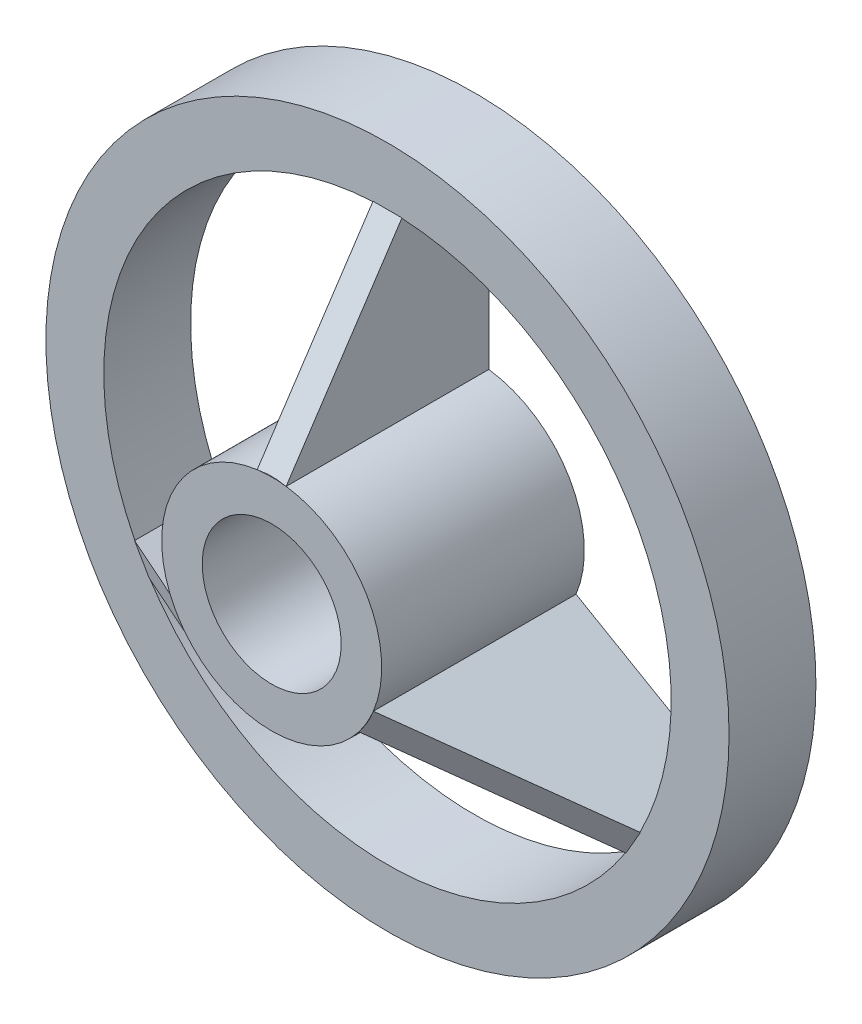
ISO-10303-21;
HEADER;
FILE_DESCRIPTION(('STEP AP214'),'2;1');
FILE_NAME('part.step','',(''),(''),'','','');
FILE_SCHEMA(('AUTOMOTIVE_DESIGN { 1 0 10303 214 1 1 1 1 }'));
ENDSEC;
DATA;
#1=APPLICATION_CONTEXT('core data for automotive mechanical design processes');
#2=APPLICATION_PROTOCOL_DEFINITION('international standard','automotive_design',2000,#1);
#3=PRODUCT_CONTEXT('',#1,'mechanical');
#4=PRODUCT('Part','Part','',(#3));
#5=PRODUCT_RELATED_PRODUCT_CATEGORY('part','',(#4));
#6=PRODUCT_DEFINITION_FORMATION('','',#4);
#7=PRODUCT_DEFINITION_CONTEXT('part definition',#1,'design');
#8=PRODUCT_DEFINITION('design','',#6,#7);
#9=PRODUCT_DEFINITION_SHAPE('','',#8);
#10=(LENGTH_UNIT() NAMED_UNIT(*) SI_UNIT(.MILLI.,.METRE.));
#11=(NAMED_UNIT(*) PLANE_ANGLE_UNIT() SI_UNIT($,.RADIAN.));
#12=(NAMED_UNIT(*) SI_UNIT($,.STERADIAN.) SOLID_ANGLE_UNIT());
#13=UNCERTAINTY_MEASURE_WITH_UNIT(LENGTH_MEASURE(1.E-05),#10,'distance_accuracy_value','');
#14=(GEOMETRIC_REPRESENTATION_CONTEXT(3) GLOBAL_UNCERTAINTY_ASSIGNED_CONTEXT((#13)) GLOBAL_UNIT_ASSIGNED_CONTEXT((#10,
#11,#12)) REPRESENTATION_CONTEXT('',''));
#15=CARTESIAN_POINT('',(0.,0.,0.));
#16=DIRECTION('',(0.,0.,1.));
#17=DIRECTION('',(1.,0.,0.));
#18=AXIS2_PLACEMENT_3D('',#15,#16,#17);
#19=CARTESIAN_POINT('',(0.,0.,1.5));
#20=DIRECTION('',(0.,0.,1.));
#21=DIRECTION('',(1.,0.,0.));
#22=AXIS2_PLACEMENT_3D('',#19,#20,#21);
#23=PLANE('',#22);
#24=DIRECTION('',(-0.866025403784443,-0.499999999999992,0.));
#25=VECTOR('',#24,1.);
#26=CARTESIAN_POINT('',(-0.124999999999998,0.216506350946111,1.5));
#27=LINE('',#26,#25);
#28=CARTESIAN_POINT('',(-4.36299775837602,-2.23030279567726,1.5));
#29=VERTEX_POINT('',#28);
#30=CARTESIAN_POINT('',(-4.36852447854377,-2.23349364905385,1.5));
#31=VERTEX_POINT('',#30);
#32=EDGE_CURVE('E178',#29,#31,#27,.T.);
#33=ORIENTED_EDGE('',*,*,#32,.F.);
#34=CARTESIAN_POINT('',(0.,0.,1.5));
#35=DIRECTION('',(0.,0.,1.));
#36=DIRECTION('',(1.,0.,0.));
#37=AXIS2_PLACEMENT_3D('',#34,#35,#36);
#38=CIRCLE('',#37,4.9);
#39=CARTESIAN_POINT('',(-0.25,4.89361829324683,1.5));
#40=VERTEX_POINT('',#39);
#41=EDGE_CURVE('E257',#40,#29,#38,.T.);
#42=ORIENTED_EDGE('',*,*,#41,.F.);
#43=DIRECTION('',(0.,-1.,0.));
#44=VECTOR('',#43,1.);
#45=CARTESIAN_POINT('',(-0.25,0.,1.5));
#46=LINE('',#45,#44);
#47=CARTESIAN_POINT('',(-0.25,4.9,1.5));
#48=VERTEX_POINT('',#47);
#49=EDGE_CURVE('E276',#48,#40,#46,.T.);
#50=ORIENTED_EDGE('',*,*,#49,.F.);
#51=DIRECTION('',(-1.,0.,0.));
#52=VECTOR('',#51,1.);
#53=CARTESIAN_POINT('',(0.25,4.9,1.5));
#54=LINE('',#53,#52);
#55=CARTESIAN_POINT('',(0.25,4.9,1.5));
#56=VERTEX_POINT('',#55);
#57=EDGE_CURVE('E302',#56,#48,#54,.T.);
#58=ORIENTED_EDGE('',*,*,#57,.F.);
#59=DIRECTION('',(0.,-1.,0.));
#60=VECTOR('',#59,1.);
#61=CARTESIAN_POINT('',(0.25,0.,1.5));
#62=LINE('',#61,#60);
#63=CARTESIAN_POINT('',(0.25,4.89361829324683,1.5));
#64=VERTEX_POINT('',#63);
#65=EDGE_CURVE('E278',#56,#64,#62,.T.);
#66=ORIENTED_EDGE('',*,*,#65,.T.);
#67=CARTESIAN_POINT('',(4.36299775837599,-2.23030279567733,1.5));
#68=VERTEX_POINT('',#67);
#69=EDGE_CURVE('E261',#68,#64,#38,.T.);
#70=ORIENTED_EDGE('',*,*,#69,.F.);
#71=DIRECTION('',(0.866025403784436,-0.500000000000004,0.));
#72=VECTOR('',#71,1.);
#73=CARTESIAN_POINT('',(0.125000000000001,0.216506350946109,1.5));
#74=LINE('',#73,#72);
#75=CARTESIAN_POINT('',(4.36852447854374,-2.23349364905391,1.5));
#76=VERTEX_POINT('',#75);
#77=EDGE_CURVE('E242',#68,#76,#74,.T.);
#78=ORIENTED_EDGE('',*,*,#77,.T.);
#79=DIRECTION('',(0.500000000000004,0.866025403784436,0.));
#80=VECTOR('',#79,1.);
#81=CARTESIAN_POINT('',(4.11852447854374,-2.66650635094613,1.5));
#82=LINE('',#81,#80);
#83=CARTESIAN_POINT('',(4.11852447854374,-2.66650635094613,1.5));
#84=VERTEX_POINT('',#83);
#85=EDGE_CURVE('E240',#84,#76,#82,.T.);
#86=ORIENTED_EDGE('',*,*,#85,.F.);
#87=DIRECTION('',(0.866025403784436,-0.500000000000004,0.));
#88=VECTOR('',#87,1.);
#89=CARTESIAN_POINT('',(-0.125000000000001,-0.216506350946109,1.5));
#90=LINE('',#89,#88);
#91=CARTESIAN_POINT('',(4.11299775837599,-2.66331549756954,1.5));
#92=VERTEX_POINT('',#91);
#93=EDGE_CURVE('E248',#92,#84,#90,.T.);
#94=ORIENTED_EDGE('',*,*,#93,.F.);
#95=CARTESIAN_POINT('',(-4.11299775837603,-2.66331549756949,1.5));
#96=VERTEX_POINT('',#95);
#97=EDGE_CURVE('E260',#96,#92,#38,.T.);
#98=ORIENTED_EDGE('',*,*,#97,.F.);
#99=DIRECTION('',(-0.866025403784443,-0.499999999999992,0.));
#100=VECTOR('',#99,1.);
#101=CARTESIAN_POINT('',(0.124999999999998,-0.216506350946111,1.5));
#102=LINE('',#101,#100);
#103=CARTESIAN_POINT('',(-4.11852447854378,-2.66650635094607,1.5));
#104=VERTEX_POINT('',#103);
#105=EDGE_CURVE('E208',#96,#104,#102,.T.);
#106=ORIENTED_EDGE('',*,*,#105,.T.);
#107=DIRECTION('',(0.499999999999992,-0.866025403784443,0.));
#108=VECTOR('',#107,1.);
#109=CARTESIAN_POINT('',(-4.36852447854377,-2.23349364905385,1.5));
#110=LINE('',#109,#108);
#111=EDGE_CURVE('E197',#31,#104,#110,.T.);
#112=ORIENTED_EDGE('',*,*,#111,.F.);
#113=EDGE_LOOP('',(#33,#42,#50,#58,#66,#70,#78,#86,#94,#98,#106,#112));
#114=FACE_BOUND('',#113,.T.);
#115=CARTESIAN_POINT('',(0.,0.,1.5));
#116=DIRECTION('',(0.,0.,1.));
#117=DIRECTION('',(1.,0.,0.));
#118=AXIS2_PLACEMENT_3D('',#115,#116,#117);
#119=CIRCLE('',#118,5.9);
#120=CARTESIAN_POINT('',(5.9,0.,1.5));
#121=VERTEX_POINT('',#120);
#122=EDGE_CURVE('E266',#121,#121,#119,.T.);
#123=ORIENTED_EDGE('',*,*,#122,.T.);
#124=EDGE_LOOP('',(#123));
#125=FACE_BOUND('',#124,.T.);
#126=ADVANCED_FACE('F40',(#114,#125),#23,.T.);
#127=CARTESIAN_POINT('',(0.,0.,3.5));
#128=DIRECTION('',(0.,0.,-1.));
#129=DIRECTION('',(-1.,0.,0.));
#130=AXIS2_PLACEMENT_3D('',#127,#128,#129);
#131=CYLINDRICAL_SURFACE('',#130,1.9);
#132=CARTESIAN_POINT('',(0.,0.,4.75060094816364));
#133=DIRECTION('',(0.478745121602799,0.27640362483059,-0.833309153149077));
#134=DIRECTION('',(-0.721666895833202,-0.416654576574532,-0.552807249661189));
#135=AXIS2_PLACEMENT_3D('',#132,#133,#134);
#136=ELLIPSE('',#135,2.28006615890381,1.9);
#137=CARTESIAN_POINT('',(-1.51415575672838,-1.14775099406025,3.5));
#138=VERTEX_POINT('',#137);
#139=CARTESIAN_POINT('',(-1.75105939643923,-0.73742185358307,3.5));
#140=VERTEX_POINT('',#139);
#141=EDGE_CURVE('E54',#138,#140,#136,.T.);
#142=ORIENTED_EDGE('',*,*,#141,.F.);
#143=CARTESIAN_POINT('',(0.,0.,3.5));
#144=DIRECTION('',(0.,0.,1.));
#145=DIRECTION('',(1.,0.,0.));
#146=AXIS2_PLACEMENT_3D('',#143,#144,#145);
#147=CIRCLE('',#146,1.9);
#148=EDGE_CURVE('E57',#140,#138,#147,.T.);
#149=ORIENTED_EDGE('',*,*,#148,.F.);
#150=EDGE_LOOP('',(#142,#149));
#151=FACE_BOUND('',#150,.T.);
#152=ADVANCED_FACE('F417',(#151),#131,.T.);
#153=DIRECTION('',(0.,0.,-1.));
#154=VECTOR('',#153,1.);
#155=CARTESIAN_POINT('',(-1.50614223781988,-1.15824676103796,3.5));
#156=LINE('',#155,#154);
#157=CARTESIAN_POINT('',(-1.50614223781988,-1.15824676103796,0.));
#158=VERTEX_POINT('',#157);
#159=CARTESIAN_POINT('',(-1.50614223781988,-1.15824676103796,3.5));
#160=VERTEX_POINT('',#159);
#161=EDGE_CURVE('E191',#158,#160,#156,.F.);
#162=ORIENTED_EDGE('',*,*,#161,.F.);
#163=CARTESIAN_POINT('',(0.,0.,0.));
#164=DIRECTION('',(0.,0.,1.));
#165=DIRECTION('',(1.,0.,0.));
#166=AXIS2_PLACEMENT_3D('',#163,#164,#165);
#167=CIRCLE('',#166,1.9);
#168=CARTESIAN_POINT('',(1.50614223781986,-1.15824676103798,0.));
#169=VERTEX_POINT('',#168);
#170=EDGE_CURVE('E319',#158,#169,#167,.T.);
#171=ORIENTED_EDGE('',*,*,#170,.T.);
#172=DIRECTION('',(0.,0.,-1.));
#173=VECTOR('',#172,1.);
#174=CARTESIAN_POINT('',(1.50614223781986,-1.15824676103799,3.5));
#175=LINE('',#174,#173);
#176=CARTESIAN_POINT('',(1.50614223781986,-1.15824676103798,3.5));
#177=VERTEX_POINT('',#176);
#178=EDGE_CURVE('E250',#169,#177,#175,.F.);
#179=ORIENTED_EDGE('',*,*,#178,.T.);
#180=EDGE_CURVE('E315',#160,#177,#147,.T.);
#181=ORIENTED_EDGE('',*,*,#180,.F.);
#182=EDGE_LOOP('',(#162,#171,#179,#181));
#183=FACE_BOUND('',#182,.T.);
#184=ADVANCED_FACE('F387',(#183),#131,.T.);
#185=CARTESIAN_POINT('',(0.,0.,1.5));
#186=DIRECTION('',(0.,0.,-1.));
#187=DIRECTION('',(-1.,0.,0.));
#188=AXIS2_PLACEMENT_3D('',#185,#186,#187);
#189=CYLINDRICAL_SURFACE('',#188,4.9);
#190=CARTESIAN_POINT('',(0.,0.,0.));
#191=DIRECTION('',(0.,0.,1.));
#192=DIRECTION('',(1.,0.,0.));
#193=AXIS2_PLACEMENT_3D('',#190,#191,#192);
#194=CIRCLE('',#193,4.9);
#195=CARTESIAN_POINT('',(-4.11299775837603,-2.66331549756949,0.));
#196=VERTEX_POINT('',#195);
#197=CARTESIAN_POINT('',(4.11299775837599,-2.66331549756954,0.));
#198=VERTEX_POINT('',#197);
#199=EDGE_CURVE('E265',#196,#198,#194,.T.);
#200=ORIENTED_EDGE('',*,*,#199,.F.);
#201=DIRECTION('',(0.,0.,-1.));
#202=VECTOR('',#201,1.);
#203=CARTESIAN_POINT('',(-4.11299775837603,-2.66331549756949,1.5));
#204=LINE('',#203,#202);
#205=EDGE_CURVE('E48',#196,#96,#204,.F.);
#206=ORIENTED_EDGE('',*,*,#205,.T.);
#207=ORIENTED_EDGE('',*,*,#97,.T.);
#208=DIRECTION('',(0.,0.,-1.));
#209=VECTOR('',#208,1.);
#210=CARTESIAN_POINT('',(4.11299775837599,-2.66331549756954,1.5));
#211=LINE('',#210,#209);
#212=EDGE_CURVE('E332',#198,#92,#211,.F.);
#213=ORIENTED_EDGE('',*,*,#212,.F.);
#214=EDGE_LOOP('',(#200,#206,#207,#213));
#215=FACE_BOUND('',#214,.T.);
#216=ADVANCED_FACE('F337',(#215),#189,.F.);
#217=CARTESIAN_POINT('',(0.,0.,4.75060094816364));
#218=DIRECTION('',(-0.478745121602795,0.276403624830597,-0.833309153149077));
#219=DIRECTION('',(0.721666895833196,-0.416654576574542,-0.552807249661189));
#220=AXIS2_PLACEMENT_3D('',#217,#218,#219);
#221=ELLIPSE('',#220,2.28006615890381,1.9);
#222=CARTESIAN_POINT('',(1.75105939643922,-0.737421853583097,3.5));
#223=VERTEX_POINT('',#222);
#224=CARTESIAN_POINT('',(1.51415575672837,-1.14775099406027,3.5));
#225=VERTEX_POINT('',#224);
#226=EDGE_CURVE('E253',#223,#225,#221,.T.);
#227=ORIENTED_EDGE('',*,*,#226,.F.);
#228=EDGE_CURVE('E395',#225,#223,#147,.T.);
#229=ORIENTED_EDGE('',*,*,#228,.F.);
#230=EDGE_LOOP('',(#227,#229));
#231=FACE_BOUND('',#230,.T.);
#232=ADVANCED_FACE('F548',(#231),#131,.T.);
#233=DIRECTION('',(0.,0.,-1.));
#234=VECTOR('',#233,1.);
#235=CARTESIAN_POINT('',(1.75614223781986,-0.725234059145767,3.5));
#236=LINE('',#235,#234);
#237=CARTESIAN_POINT('',(1.75614223781986,-0.725234059145767,0.));
#238=VERTEX_POINT('',#237);
#239=CARTESIAN_POINT('',(1.75614223781986,-0.725234059145767,3.5));
#240=VERTEX_POINT('',#239);
#241=EDGE_CURVE('E245',#238,#240,#236,.F.);
#242=ORIENTED_EDGE('',*,*,#241,.F.);
#243=CARTESIAN_POINT('',(0.25,1.88348082018374,0.));
#244=VERTEX_POINT('',#243);
#245=EDGE_CURVE('E308',#238,#244,#167,.T.);
#246=ORIENTED_EDGE('',*,*,#245,.T.);
#247=DIRECTION('',(0.,0.,-1.));
#248=VECTOR('',#247,1.);
#249=CARTESIAN_POINT('',(0.25,1.88348082018374,3.5));
#250=LINE('',#249,#248);
#251=CARTESIAN_POINT('',(0.25,1.88348082018374,3.5));
#252=VERTEX_POINT('',#251);
#253=EDGE_CURVE('E323',#244,#252,#250,.F.);
#254=ORIENTED_EDGE('',*,*,#253,.T.);
#255=EDGE_CURVE('E318',#240,#252,#147,.T.);
#256=ORIENTED_EDGE('',*,*,#255,.F.);
#257=EDGE_LOOP('',(#242,#246,#254,#256));
#258=FACE_BOUND('',#257,.T.);
#259=ADVANCED_FACE('F388',(#258),#131,.T.);
#260=CARTESIAN_POINT('',(4.36299775837599,-2.23030279567733,0.));
#261=VERTEX_POINT('',#260);
#262=CARTESIAN_POINT('',(0.25,4.89361829324683,0.));
#263=VERTEX_POINT('',#262);
#264=EDGE_CURVE('E256',#261,#263,#194,.T.);
#265=ORIENTED_EDGE('',*,*,#264,.F.);
#266=DIRECTION('',(0.,0.,-1.));
#267=VECTOR('',#266,1.);
#268=CARTESIAN_POINT('',(4.36299775837599,-2.23030279567733,1.5));
#269=LINE('',#268,#267);
#270=EDGE_CURVE('E329',#261,#68,#269,.F.);
#271=ORIENTED_EDGE('',*,*,#270,.T.);
#272=ORIENTED_EDGE('',*,*,#69,.T.);
#273=DIRECTION('',(0.,0.,-1.));
#274=VECTOR('',#273,1.);
#275=CARTESIAN_POINT('',(0.25,4.89361829324683,1.5));
#276=LINE('',#275,#274);
#277=EDGE_CURVE('E273',#64,#263,#276,.T.);
#278=ORIENTED_EDGE('',*,*,#277,.T.);
#279=EDGE_LOOP('',(#265,#271,#272,#278));
#280=FACE_BOUND('',#279,.T.);
#281=ADVANCED_FACE('F348',(#280),#189,.F.);
#282=CARTESIAN_POINT('',(0.,0.,4.75060094816364));
#283=DIRECTION('',(0.,-0.552807249661189,-0.833309153149077));
#284=DIRECTION('',(0.,0.833309153149077,-0.552807249661189));
#285=AXIS2_PLACEMENT_3D('',#282,#283,#284);
#286=ELLIPSE('',#285,2.28006615890381,1.9);
#287=CARTESIAN_POINT('',(-0.236903639710849,1.88517284764335,3.5));
#288=VERTEX_POINT('',#287);
#289=CARTESIAN_POINT('',(0.236903639710849,1.88517284764335,3.5));
#290=VERTEX_POINT('',#289);
#291=EDGE_CURVE('E326',#288,#290,#286,.T.);
#292=ORIENTED_EDGE('',*,*,#291,.F.);
#293=EDGE_CURVE('E314',#290,#288,#147,.T.);
#294=ORIENTED_EDGE('',*,*,#293,.F.);
#295=EDGE_LOOP('',(#292,#294));
#296=FACE_BOUND('',#295,.T.);
#297=ADVANCED_FACE('F418',(#296),#131,.T.);
#298=CARTESIAN_POINT('',(0.,0.,3.5));
#299=DIRECTION('',(0.,0.,1.));
#300=DIRECTION('',(1.,0.,0.));
#301=AXIS2_PLACEMENT_3D('',#298,#299,#300);
#302=PLANE('',#301);
#303=CARTESIAN_POINT('',(-0.25,1.88348082018374,3.5));
#304=VERTEX_POINT('',#303);
#305=CARTESIAN_POINT('',(-1.75614223781987,-0.725234059145742,3.5));
#306=VERTEX_POINT('',#305);
#307=EDGE_CURVE('E311',#304,#306,#147,.T.);
#308=ORIENTED_EDGE('',*,*,#307,.T.);
#309=DIRECTION('',(0.866025403784443,0.499999999999992,0.));
#310=VECTOR('',#309,1.);
#311=CARTESIAN_POINT('',(-1.7576075765838,-0.726080072875551,3.5));
#312=LINE('',#311,#310);
#313=CARTESIAN_POINT('',(-1.7576075765838,-0.726080072875551,3.5));
#314=VERTEX_POINT('',#313);
#315=EDGE_CURVE('E202',#314,#306,#312,.T.);
#316=ORIENTED_EDGE('',*,*,#315,.F.);
#317=DIRECTION('',(0.499999999999992,-0.866025403784443,0.));
#318=VECTOR('',#317,1.);
#319=CARTESIAN_POINT('',(-1.7576075765838,-0.726080072875551,3.5));
#320=LINE('',#319,#318);
#321=EDGE_CURVE('E200',#314,#140,#320,.T.);
#322=ORIENTED_EDGE('',*,*,#321,.T.);
#323=ORIENTED_EDGE('',*,*,#148,.T.);
#324=CARTESIAN_POINT('',(-1.50760757658381,-1.15909277476777,3.5));
#325=VERTEX_POINT('',#324);
#326=EDGE_CURVE('E211',#138,#325,#320,.T.);
#327=ORIENTED_EDGE('',*,*,#326,.T.);
#328=DIRECTION('',(0.866025403784443,0.499999999999992,0.));
#329=VECTOR('',#328,1.);
#330=CARTESIAN_POINT('',(-1.50760757658381,-1.15909277476777,3.5));
#331=LINE('',#330,#329);
#332=EDGE_CURVE('E402',#325,#160,#331,.T.);
#333=ORIENTED_EDGE('',*,*,#332,.T.);
#334=ORIENTED_EDGE('',*,*,#180,.T.);
#335=DIRECTION('',(-0.866025403784436,0.500000000000004,0.));
#336=VECTOR('',#335,1.);
#337=CARTESIAN_POINT('',(1.50760757658379,-1.15909277476779,3.5));
#338=LINE('',#337,#336);
#339=CARTESIAN_POINT('',(1.50760757658379,-1.15909277476779,3.5));
#340=VERTEX_POINT('',#339);
#341=EDGE_CURVE('E226',#340,#177,#338,.T.);
#342=ORIENTED_EDGE('',*,*,#341,.F.);
#343=DIRECTION('',(0.500000000000004,0.866025403784436,0.));
#344=VECTOR('',#343,1.);
#345=CARTESIAN_POINT('',(1.50760757658379,-1.15909277476779,3.5));
#346=LINE('',#345,#344);
#347=EDGE_CURVE('E237',#340,#225,#346,.T.);
#348=ORIENTED_EDGE('',*,*,#347,.T.);
#349=ORIENTED_EDGE('',*,*,#228,.T.);
#350=CARTESIAN_POINT('',(1.75760757658379,-0.726080072875576,3.5));
#351=VERTEX_POINT('',#350);
#352=EDGE_CURVE('E229',#223,#351,#346,.T.);
#353=ORIENTED_EDGE('',*,*,#352,.T.);
#354=DIRECTION('',(-0.866025403784436,0.500000000000004,0.));
#355=VECTOR('',#354,1.);
#356=CARTESIAN_POINT('',(1.75760757658379,-0.726080072875576,3.5));
#357=LINE('',#356,#355);
#358=EDGE_CURVE('E224',#351,#240,#357,.T.);
#359=ORIENTED_EDGE('',*,*,#358,.T.);
#360=ORIENTED_EDGE('',*,*,#255,.T.);
#361=DIRECTION('',(0.,-1.,0.));
#362=VECTOR('',#361,1.);
#363=CARTESIAN_POINT('',(0.25,1.88517284764335,3.5));
#364=LINE('',#363,#362);
#365=CARTESIAN_POINT('',(0.25,1.88517284764335,3.5));
#366=VERTEX_POINT('',#365);
#367=EDGE_CURVE('E288',#366,#252,#364,.T.);
#368=ORIENTED_EDGE('',*,*,#367,.F.);
#369=DIRECTION('',(-1.,0.,0.));
#370=VECTOR('',#369,1.);
#371=CARTESIAN_POINT('',(0.25,1.88517284764335,3.5));
#372=LINE('',#371,#370);
#373=EDGE_CURVE('E299',#366,#290,#372,.T.);
#374=ORIENTED_EDGE('',*,*,#373,.T.);
#375=ORIENTED_EDGE('',*,*,#293,.T.);
#376=CARTESIAN_POINT('',(-0.25,1.88517284764335,3.5));
#377=VERTEX_POINT('',#376);
#378=EDGE_CURVE('E291',#288,#377,#372,.T.);
#379=ORIENTED_EDGE('',*,*,#378,.T.);
#380=DIRECTION('',(0.,-1.,0.));
#381=VECTOR('',#380,1.);
#382=CARTESIAN_POINT('',(-0.25,1.88517284764335,3.5));
#383=LINE('',#382,#381);
#384=EDGE_CURVE('E286',#377,#304,#383,.T.);
#385=ORIENTED_EDGE('',*,*,#384,.T.);
#386=EDGE_LOOP('',(#308,#316,#322,#323,#327,#333,#334,#342,#348,#349,#353,#359,#360,#368,#374,
#375,#379,#385));
#387=FACE_BOUND('',#386,.T.);
#388=CARTESIAN_POINT('',(0.,0.,3.5));
#389=DIRECTION('',(0.,0.,1.));
#390=DIRECTION('',(1.,0.,0.));
#391=AXIS2_PLACEMENT_3D('',#388,#389,#390);
#392=CIRCLE('',#391,1.2);
#393=CARTESIAN_POINT('',(1.2,0.,3.5));
#394=VERTEX_POINT('',#393);
#395=EDGE_CURVE('E305',#394,#394,#392,.T.);
#396=ORIENTED_EDGE('',*,*,#395,.F.);
#397=EDGE_LOOP('',(#396));
#398=FACE_BOUND('',#397,.T.);
#399=ADVANCED_FACE('F367',(#387,#398),#302,.T.);
#400=CARTESIAN_POINT('',(0.,0.,0.));
#401=DIRECTION('',(0.,0.,1.));
#402=DIRECTION('',(1.,0.,0.));
#403=AXIS2_PLACEMENT_3D('',#400,#401,#402);
#404=PLANE('',#403);
#405=DIRECTION('',(-0.866025403784443,-0.499999999999992,0.));
#406=VECTOR('',#405,1.);
#407=CARTESIAN_POINT('',(-4.36852447854377,-2.23349364905385,0.));
#408=LINE('',#407,#406);
#409=CARTESIAN_POINT('',(-1.75614223781987,-0.725234059145742,0.));
#410=VERTEX_POINT('',#409);
#411=CARTESIAN_POINT('',(-4.36299775837602,-2.23030279567726,0.));
#412=VERTEX_POINT('',#411);
#413=EDGE_CURVE('E203',#410,#412,#408,.T.);
#414=ORIENTED_EDGE('',*,*,#413,.F.);
#415=CARTESIAN_POINT('',(-0.25,1.88348082018374,0.));
#416=VERTEX_POINT('',#415);
#417=EDGE_CURVE('E316',#416,#410,#167,.T.);
#418=ORIENTED_EDGE('',*,*,#417,.F.);
#419=DIRECTION('',(0.,1.,0.));
#420=VECTOR('',#419,1.);
#421=CARTESIAN_POINT('',(-0.25,4.9,0.));
#422=LINE('',#421,#420);
#423=CARTESIAN_POINT('',(-0.25,4.89361829324683,0.));
#424=VERTEX_POINT('',#423);
#425=EDGE_CURVE('E281',#416,#424,#422,.T.);
#426=ORIENTED_EDGE('',*,*,#425,.T.);
#427=EDGE_CURVE('E262',#424,#412,#194,.T.);
#428=ORIENTED_EDGE('',*,*,#427,.T.);
#429=EDGE_LOOP('',(#414,#418,#426,#428));
#430=FACE_BOUND('',#429,.T.);
#431=ORIENTED_EDGE('',*,*,#170,.F.);
#432=DIRECTION('',(-0.866025403784443,-0.499999999999992,0.));
#433=VECTOR('',#432,1.);
#434=CARTESIAN_POINT('',(-4.11852447854378,-2.66650635094607,0.));
#435=LINE('',#434,#433);
#436=EDGE_CURVE('E381',#158,#196,#435,.T.);
#437=ORIENTED_EDGE('',*,*,#436,.T.);
#438=ORIENTED_EDGE('',*,*,#199,.T.);
#439=DIRECTION('',(0.866025403784436,-0.500000000000004,0.));
#440=VECTOR('',#439,1.);
#441=CARTESIAN_POINT('',(4.11852447854374,-2.66650635094613,0.));
#442=LINE('',#441,#440);
#443=EDGE_CURVE('E220',#169,#198,#442,.T.);
#444=ORIENTED_EDGE('',*,*,#443,.F.);
#445=EDGE_LOOP('',(#431,#437,#438,#444));
#446=FACE_BOUND('',#445,.T.);
#447=CARTESIAN_POINT('',(0.,0.,0.));
#448=DIRECTION('',(0.,0.,1.));
#449=DIRECTION('',(1.,0.,0.));
#450=AXIS2_PLACEMENT_3D('',#447,#448,#449);
#451=CIRCLE('',#450,1.2);
#452=CARTESIAN_POINT('',(1.2,0.,0.));
#453=VERTEX_POINT('',#452);
#454=EDGE_CURVE('E304',#453,#453,#451,.T.);
#455=ORIENTED_EDGE('',*,*,#454,.T.);
#456=EDGE_LOOP('',(#455));
#457=FACE_BOUND('',#456,.T.);
#458=CARTESIAN_POINT('',(0.,0.,0.));
#459=DIRECTION('',(0.,0.,1.));
#460=DIRECTION('',(1.,0.,0.));
#461=AXIS2_PLACEMENT_3D('',#458,#459,#460);
#462=CIRCLE('',#461,5.9);
#463=CARTESIAN_POINT('',(5.9,0.,0.));
#464=VERTEX_POINT('',#463);
#465=EDGE_CURVE('E259',#464,#464,#462,.T.);
#466=ORIENTED_EDGE('',*,*,#465,.F.);
#467=EDGE_LOOP('',(#466));
#468=FACE_BOUND('',#467,.T.);
#469=ORIENTED_EDGE('',*,*,#245,.F.);
#470=DIRECTION('',(0.866025403784436,-0.500000000000004,0.));
#471=VECTOR('',#470,1.);
#472=CARTESIAN_POINT('',(4.36852447854374,-2.23349364905391,0.));
#473=LINE('',#472,#471);
#474=EDGE_CURVE('E219',#238,#261,#473,.T.);
#475=ORIENTED_EDGE('',*,*,#474,.T.);
#476=ORIENTED_EDGE('',*,*,#264,.T.);
#477=DIRECTION('',(0.,1.,0.));
#478=VECTOR('',#477,1.);
#479=CARTESIAN_POINT('',(0.25,4.9,0.));
#480=LINE('',#479,#478);
#481=EDGE_CURVE('E282',#244,#263,#480,.T.);
#482=ORIENTED_EDGE('',*,*,#481,.F.);
#483=EDGE_LOOP('',(#469,#475,#476,#482));
#484=FACE_BOUND('',#483,.T.);
#485=ADVANCED_FACE('F375',(#430,#446,#457,#468,#484),#404,.F.);
#486=ORIENTED_EDGE('',*,*,#417,.T.);
#487=DIRECTION('',(0.,0.,-1.));
#488=VECTOR('',#487,1.);
#489=CARTESIAN_POINT('',(-1.75614223781987,-0.725234059145742,3.5));
#490=LINE('',#489,#488);
#491=EDGE_CURVE('E190',#410,#306,#490,.F.);
#492=ORIENTED_EDGE('',*,*,#491,.T.);
#493=ORIENTED_EDGE('',*,*,#307,.F.);
#494=DIRECTION('',(0.,0.,-1.));
#495=VECTOR('',#494,1.);
#496=CARTESIAN_POINT('',(-0.25,1.88348082018374,3.5));
#497=LINE('',#496,#495);
#498=EDGE_CURVE('E320',#416,#304,#497,.F.);
#499=ORIENTED_EDGE('',*,*,#498,.F.);
#500=EDGE_LOOP('',(#486,#492,#493,#499));
#501=FACE_BOUND('',#500,.T.);
#502=ADVANCED_FACE('F42',(#501),#131,.T.);
#503=CARTESIAN_POINT('',(0.,0.,3.5));
#504=DIRECTION('',(0.,0.,-1.));
#505=DIRECTION('',(-1.,0.,0.));
#506=AXIS2_PLACEMENT_3D('',#503,#504,#505);
#507=CYLINDRICAL_SURFACE('',#506,1.2);
#508=ORIENTED_EDGE('',*,*,#395,.T.);
#509=EDGE_LOOP('',(#508));
#510=FACE_BOUND('',#509,.T.);
#511=ORIENTED_EDGE('',*,*,#454,.F.);
#512=EDGE_LOOP('',(#511));
#513=FACE_BOUND('',#512,.T.);
#514=ADVANCED_FACE('F416',(#510,#513),#507,.F.);
#515=CARTESIAN_POINT('',(0.25,4.9,1.5));
#516=DIRECTION('',(0.,-0.552807249661189,-0.833309153149077));
#517=DIRECTION('',(0.,0.833309153149077,-0.552807249661189));
#518=AXIS2_PLACEMENT_3D('',#515,#516,#517);
#519=PLANE('',#518);
#520=ORIENTED_EDGE('',*,*,#378,.F.);
#521=ORIENTED_EDGE('',*,*,#291,.T.);
#522=ORIENTED_EDGE('',*,*,#373,.F.);
#523=DIRECTION('',(0.,-0.833309153149077,0.552807249661189));
#524=VECTOR('',#523,1.);
#525=CARTESIAN_POINT('',(0.25,4.9,1.5));
#526=LINE('',#525,#524);
#527=EDGE_CURVE('E285',#56,#366,#526,.T.);
#528=ORIENTED_EDGE('',*,*,#527,.F.);
#529=ORIENTED_EDGE('',*,*,#57,.T.);
#530=DIRECTION('',(0.,-0.833309153149077,0.552807249661189));
#531=VECTOR('',#530,1.);
#532=CARTESIAN_POINT('',(-0.25,4.9,1.5));
#533=LINE('',#532,#531);
#534=EDGE_CURVE('E294',#48,#377,#533,.T.);
#535=ORIENTED_EDGE('',*,*,#534,.T.);
#536=EDGE_LOOP('',(#520,#521,#522,#528,#529,#535));
#537=FACE_BOUND('',#536,.T.);
#538=ADVANCED_FACE('F359',(#537),#519,.F.);
#539=CARTESIAN_POINT('',(0.25,0.,0.));
#540=DIRECTION('',(1.,0.,0.));
#541=DIRECTION('',(0.,0.,-1.));
#542=AXIS2_PLACEMENT_3D('',#539,#540,#541);
#543=PLANE('',#542);
#544=ORIENTED_EDGE('',*,*,#65,.F.);
#545=ORIENTED_EDGE('',*,*,#527,.T.);
#546=ORIENTED_EDGE('',*,*,#367,.T.);
#547=ORIENTED_EDGE('',*,*,#253,.F.);
#548=ORIENTED_EDGE('',*,*,#481,.T.);
#549=ORIENTED_EDGE('',*,*,#277,.F.);
#550=EDGE_LOOP('',(#544,#545,#546,#547,#548,#549));
#551=FACE_BOUND('',#550,.T.);
#552=ADVANCED_FACE('F350',(#551),#543,.T.);
#553=CARTESIAN_POINT('',(-0.25,0.,0.));
#554=DIRECTION('',(1.,0.,0.));
#555=DIRECTION('',(0.,0.,-1.));
#556=AXIS2_PLACEMENT_3D('',#553,#554,#555);
#557=PLANE('',#556);
#558=ORIENTED_EDGE('',*,*,#534,.F.);
#559=ORIENTED_EDGE('',*,*,#49,.T.);
#560=DIRECTION('',(0.,0.,-1.));
#561=VECTOR('',#560,1.);
#562=CARTESIAN_POINT('',(-0.25,4.89361829324683,1.5));
#563=LINE('',#562,#561);
#564=EDGE_CURVE('E269',#40,#424,#563,.T.);
#565=ORIENTED_EDGE('',*,*,#564,.T.);
#566=ORIENTED_EDGE('',*,*,#425,.F.);
#567=ORIENTED_EDGE('',*,*,#498,.T.);
#568=ORIENTED_EDGE('',*,*,#384,.F.);
#569=EDGE_LOOP('',(#558,#559,#565,#566,#567,#568));
#570=FACE_BOUND('',#569,.T.);
#571=ADVANCED_FACE('F363',(#570),#557,.F.);
#572=DIRECTION('',(0.,0.,-1.));
#573=VECTOR('',#572,1.);
#574=CARTESIAN_POINT('',(-4.36299775837602,-2.23030279567726,1.5));
#575=LINE('',#574,#573);
#576=EDGE_CURVE('E12',#412,#29,#575,.F.);
#577=ORIENTED_EDGE('',*,*,#576,.F.);
#578=ORIENTED_EDGE('',*,*,#427,.F.);
#579=ORIENTED_EDGE('',*,*,#564,.F.);
#580=ORIENTED_EDGE('',*,*,#41,.T.);
#581=EDGE_LOOP('',(#577,#578,#579,#580));
#582=FACE_BOUND('',#581,.T.);
#583=ADVANCED_FACE('F413',(#582),#189,.F.);
#584=CARTESIAN_POINT('',(0.,0.,1.5));
#585=DIRECTION('',(0.,0.,-1.));
#586=DIRECTION('',(-1.,0.,0.));
#587=AXIS2_PLACEMENT_3D('',#584,#585,#586);
#588=CYLINDRICAL_SURFACE('',#587,5.9);
#589=ORIENTED_EDGE('',*,*,#122,.F.);
#590=EDGE_LOOP('',(#589));
#591=FACE_BOUND('',#590,.T.);
#592=ORIENTED_EDGE('',*,*,#465,.T.);
#593=EDGE_LOOP('',(#592));
#594=FACE_BOUND('',#593,.T.);
#595=ADVANCED_FACE('F434',(#591,#594),#588,.T.);
#596=CARTESIAN_POINT('',(4.11852447854374,-2.66650635094613,1.5));
#597=DIRECTION('',(-0.478745121602795,0.276403624830597,-0.833309153149077));
#598=DIRECTION('',(-0.867089538473535,0.,0.498152318342243));
#599=AXIS2_PLACEMENT_3D('',#596,#597,#598);
#600=PLANE('',#599);
#601=ORIENTED_EDGE('',*,*,#352,.F.);
#602=ORIENTED_EDGE('',*,*,#226,.T.);
#603=ORIENTED_EDGE('',*,*,#347,.F.);
#604=DIRECTION('',(-0.721666895833196,0.416654576574542,0.552807249661189));
#605=VECTOR('',#604,1.);
#606=CARTESIAN_POINT('',(4.11852447854374,-2.66650635094613,1.5));
#607=LINE('',#606,#605);
#608=EDGE_CURVE('E223',#84,#340,#607,.T.);
#609=ORIENTED_EDGE('',*,*,#608,.F.);
#610=ORIENTED_EDGE('',*,*,#85,.T.);
#611=DIRECTION('',(-0.721666895833196,0.416654576574542,0.552807249661189));
#612=VECTOR('',#611,1.);
#613=CARTESIAN_POINT('',(4.36852447854374,-2.23349364905391,1.5));
#614=LINE('',#613,#612);
#615=EDGE_CURVE('E232',#76,#351,#614,.T.);
#616=ORIENTED_EDGE('',*,*,#615,.T.);
#617=EDGE_LOOP('',(#601,#602,#603,#609,#610,#616));
#618=FACE_BOUND('',#617,.T.);
#619=ADVANCED_FACE('F397',(#618),#600,.F.);
#620=CARTESIAN_POINT('',(-0.125000000000001,-0.216506350946109,0.));
#621=DIRECTION('',(-0.500000000000004,-0.866025403784436,0.));
#622=DIRECTION('',(0.,0.,-1.));
#623=AXIS2_PLACEMENT_3D('',#620,#621,#622);
#624=PLANE('',#623);
#625=ORIENTED_EDGE('',*,*,#178,.F.);
#626=ORIENTED_EDGE('',*,*,#443,.T.);
#627=ORIENTED_EDGE('',*,*,#212,.T.);
#628=ORIENTED_EDGE('',*,*,#93,.T.);
#629=ORIENTED_EDGE('',*,*,#608,.T.);
#630=ORIENTED_EDGE('',*,*,#341,.T.);
#631=EDGE_LOOP('',(#625,#626,#627,#628,#629,#630));
#632=FACE_BOUND('',#631,.T.);
#633=ADVANCED_FACE('F384',(#632),#624,.T.);
#634=CARTESIAN_POINT('',(0.125000000000001,0.216506350946109,0.));
#635=DIRECTION('',(-0.500000000000004,-0.866025403784436,0.));
#636=DIRECTION('',(0.,0.,-1.));
#637=AXIS2_PLACEMENT_3D('',#634,#635,#636);
#638=PLANE('',#637);
#639=ORIENTED_EDGE('',*,*,#474,.F.);
#640=ORIENTED_EDGE('',*,*,#241,.T.);
#641=ORIENTED_EDGE('',*,*,#358,.F.);
#642=ORIENTED_EDGE('',*,*,#615,.F.);
#643=ORIENTED_EDGE('',*,*,#77,.F.);
#644=ORIENTED_EDGE('',*,*,#270,.F.);
#645=EDGE_LOOP('',(#639,#640,#641,#642,#643,#644));
#646=FACE_BOUND('',#645,.T.);
#647=ADVANCED_FACE('F391',(#646),#638,.F.);
#648=CARTESIAN_POINT('',(-4.36852447854377,-2.23349364905385,1.5));
#649=DIRECTION('',(0.478745121602799,0.27640362483059,-0.833309153149077));
#650=DIRECTION('',(-0.867089538473533,0.,-0.498152318342246));
#651=AXIS2_PLACEMENT_3D('',#648,#649,#650);
#652=PLANE('',#651);
#653=ORIENTED_EDGE('',*,*,#326,.F.);
#654=ORIENTED_EDGE('',*,*,#141,.T.);
#655=ORIENTED_EDGE('',*,*,#321,.F.);
#656=DIRECTION('',(0.721666895833202,0.416654576574532,0.552807249661189));
#657=VECTOR('',#656,1.);
#658=CARTESIAN_POINT('',(-4.36852447854377,-2.23349364905385,1.5));
#659=LINE('',#658,#657);
#660=EDGE_CURVE('E183',#31,#314,#659,.T.);
#661=ORIENTED_EDGE('',*,*,#660,.F.);
#662=ORIENTED_EDGE('',*,*,#111,.T.);
#663=DIRECTION('',(0.721666895833202,0.416654576574532,0.552807249661189));
#664=VECTOR('',#663,1.);
#665=CARTESIAN_POINT('',(-4.11852447854378,-2.66650635094607,1.5));
#666=LINE('',#665,#664);
#667=EDGE_CURVE('E403',#104,#325,#666,.T.);
#668=ORIENTED_EDGE('',*,*,#667,.T.);
#669=EDGE_LOOP('',(#653,#654,#655,#661,#662,#668));
#670=FACE_BOUND('',#669,.T.);
#671=ADVANCED_FACE('F195',(#670),#652,.F.);
#672=CARTESIAN_POINT('',(-0.124999999999998,0.216506350946111,0.));
#673=DIRECTION('',(-0.499999999999992,0.866025403784443,0.));
#674=DIRECTION('',(0.,0.,-1.));
#675=AXIS2_PLACEMENT_3D('',#672,#673,#674);
#676=PLANE('',#675);
#677=ORIENTED_EDGE('',*,*,#491,.F.);
#678=ORIENTED_EDGE('',*,*,#413,.T.);
#679=ORIENTED_EDGE('',*,*,#576,.T.);
#680=ORIENTED_EDGE('',*,*,#32,.T.);
#681=ORIENTED_EDGE('',*,*,#660,.T.);
#682=ORIENTED_EDGE('',*,*,#315,.T.);
#683=EDGE_LOOP('',(#677,#678,#679,#680,#681,#682));
#684=FACE_BOUND('',#683,.T.);
#685=ADVANCED_FACE('F181',(#684),#676,.T.);
#686=CARTESIAN_POINT('',(0.124999999999998,-0.216506350946111,0.));
#687=DIRECTION('',(-0.499999999999992,0.866025403784443,0.));
#688=DIRECTION('',(0.,0.,-1.));
#689=AXIS2_PLACEMENT_3D('',#686,#687,#688);
#690=PLANE('',#689);
#691=ORIENTED_EDGE('',*,*,#436,.F.);
#692=ORIENTED_EDGE('',*,*,#161,.T.);
#693=ORIENTED_EDGE('',*,*,#332,.F.);
#694=ORIENTED_EDGE('',*,*,#667,.F.);
#695=ORIENTED_EDGE('',*,*,#105,.F.);
#696=ORIENTED_EDGE('',*,*,#205,.F.);
#697=EDGE_LOOP('',(#691,#692,#693,#694,#695,#696));
#698=FACE_BOUND('',#697,.T.);
#699=ADVANCED_FACE('F511',(#698),#690,.F.);
#700=CLOSED_SHELL('',(#126,#152,#184,#216,#232,#259,#281,#297,#399,#485,#502,#514,#538,#552,
#571,#583,#595,#619,#633,#647,#671,#685,#699));
#701=MANIFOLD_SOLID_BREP('B2',#700);
#702=ADVANCED_BREP_SHAPE_REPRESENTATION('',(#18,#701),#14);
#703=SHAPE_DEFINITION_REPRESENTATION(#9,#702);
ENDSEC;
END-ISO-10303-21;
